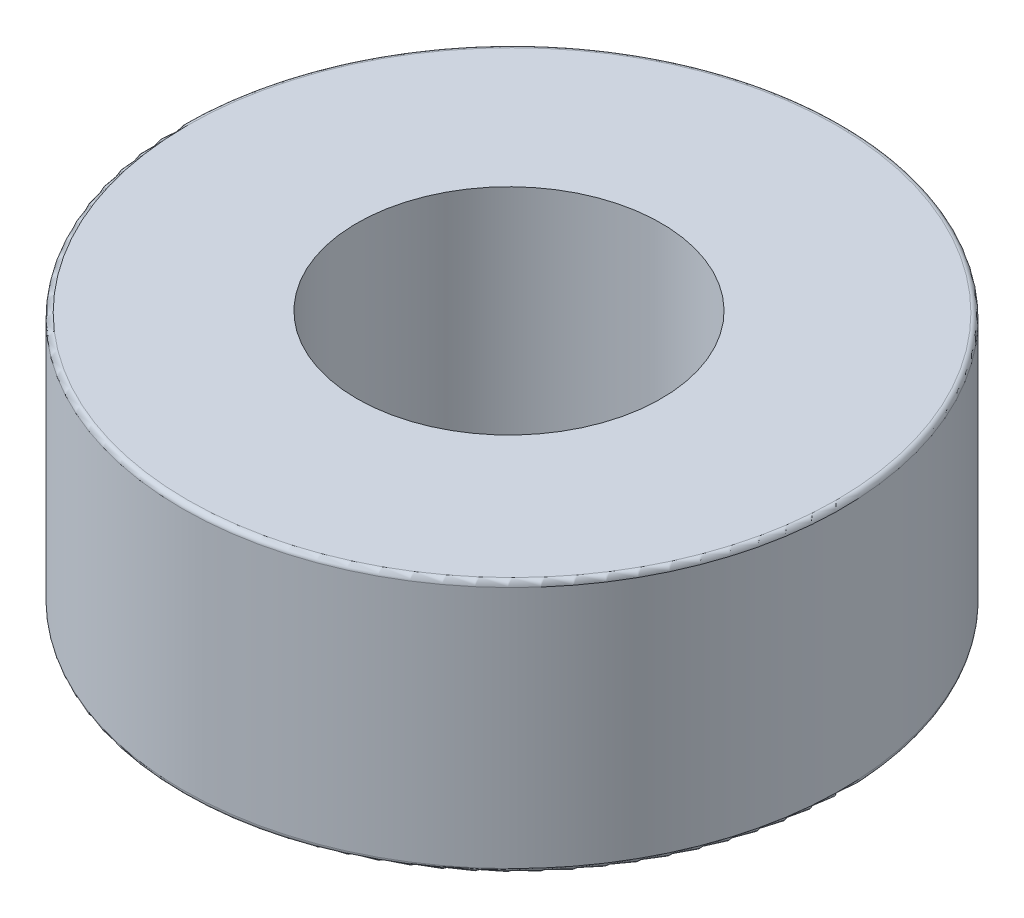
ISO-10303-21;
HEADER;
FILE_DESCRIPTION(('STEP AP214'),'2;1');
FILE_NAME('part.step','',(''),(''),'','','');
FILE_SCHEMA(('AUTOMOTIVE_DESIGN { 1 0 10303 214 1 1 1 1 }'));
ENDSEC;
DATA;
#1=APPLICATION_CONTEXT('core data for automotive mechanical design processes');
#2=APPLICATION_PROTOCOL_DEFINITION('international standard','automotive_design',2000,#1);
#3=PRODUCT_CONTEXT('',#1,'mechanical');
#4=PRODUCT('Part','Part','',(#3));
#5=PRODUCT_RELATED_PRODUCT_CATEGORY('part','',(#4));
#6=PRODUCT_DEFINITION_FORMATION('','',#4);
#7=PRODUCT_DEFINITION_CONTEXT('part definition',#1,'design');
#8=PRODUCT_DEFINITION('design','',#6,#7);
#9=PRODUCT_DEFINITION_SHAPE('','',#8);
#10=(LENGTH_UNIT() NAMED_UNIT(*) SI_UNIT(.MILLI.,.METRE.));
#11=(NAMED_UNIT(*) PLANE_ANGLE_UNIT() SI_UNIT($,.RADIAN.));
#12=(NAMED_UNIT(*) SI_UNIT($,.STERADIAN.) SOLID_ANGLE_UNIT());
#13=UNCERTAINTY_MEASURE_WITH_UNIT(LENGTH_MEASURE(1.E-05),#10,'distance_accuracy_value','');
#14=(GEOMETRIC_REPRESENTATION_CONTEXT(3) GLOBAL_UNCERTAINTY_ASSIGNED_CONTEXT((#13)) GLOBAL_UNIT_ASSIGNED_CONTEXT((#10,
#11,#12)) REPRESENTATION_CONTEXT('',''));
#15=CARTESIAN_POINT('',(0.,0.,0.));
#16=DIRECTION('',(0.,0.,1.));
#17=DIRECTION('',(1.,0.,0.));
#18=AXIS2_PLACEMENT_3D('',#15,#16,#17);
#19=CARTESIAN_POINT('',(0.0597931372441155,5.,0.));
#20=DIRECTION('',(0.,1.,0.));
#21=DIRECTION('',(0.,0.,1.));
#22=AXIS2_PLACEMENT_3D('',#19,#20,#21);
#23=PLANE('',#22);
#24=CARTESIAN_POINT('',(0.0597931372441155,5.,0.));
#25=DIRECTION('',(0.,1.,0.));
#26=DIRECTION('',(0.,0.,1.));
#27=AXIS2_PLACEMENT_3D('',#24,#25,#26);
#28=CIRCLE('',#27,6.4);
#29=CARTESIAN_POINT('',(0.0597931372441155,5.,6.4));
#30=VERTEX_POINT('',#29);
#31=EDGE_CURVE('E10',#30,#30,#28,.T.);
#32=ORIENTED_EDGE('',*,*,#31,.T.);
#33=EDGE_LOOP('',(#32));
#34=FACE_BOUND('',#33,.T.);
#35=CARTESIAN_POINT('',(0.,5.,0.));
#36=DIRECTION('',(0.,1.,0.));
#37=DIRECTION('',(0.,0.,1.));
#38=AXIS2_PLACEMENT_3D('',#35,#36,#37);
#39=CIRCLE('',#38,3.);
#40=CARTESIAN_POINT('',(0.,5.,3.));
#41=VERTEX_POINT('',#40);
#42=EDGE_CURVE('E65',#41,#41,#39,.T.);
#43=ORIENTED_EDGE('',*,*,#42,.F.);
#44=EDGE_LOOP('',(#43));
#45=FACE_BOUND('',#44,.T.);
#46=ADVANCED_FACE('F41',(#34,#45),#23,.T.);
#47=CARTESIAN_POINT('',(0.0597931372441155,0.,0.));
#48=DIRECTION('',(0.,1.,0.));
#49=DIRECTION('',(0.,0.,1.));
#50=AXIS2_PLACEMENT_3D('',#47,#48,#49);
#51=PLANE('',#50);
#52=CARTESIAN_POINT('',(0.0597931372441155,0.,0.));
#53=DIRECTION('',(0.,1.,0.));
#54=DIRECTION('',(0.,0.,1.));
#55=AXIS2_PLACEMENT_3D('',#52,#53,#54);
#56=CIRCLE('',#55,6.4);
#57=CARTESIAN_POINT('',(0.0597931372441155,0.,6.4));
#58=VERTEX_POINT('',#57);
#59=EDGE_CURVE('E49',#58,#58,#56,.F.);
#60=ORIENTED_EDGE('',*,*,#59,.T.);
#61=EDGE_LOOP('',(#60));
#62=FACE_BOUND('',#61,.T.);
#63=CARTESIAN_POINT('',(0.,0.,0.));
#64=DIRECTION('',(0.,1.,0.));
#65=DIRECTION('',(0.,0.,1.));
#66=AXIS2_PLACEMENT_3D('',#63,#64,#65);
#67=CIRCLE('',#66,3.);
#68=CARTESIAN_POINT('',(0.,0.,3.));
#69=VERTEX_POINT('',#68);
#70=EDGE_CURVE('E66',#69,#69,#67,.T.);
#71=ORIENTED_EDGE('',*,*,#70,.T.);
#72=EDGE_LOOP('',(#71));
#73=FACE_BOUND('',#72,.T.);
#74=ADVANCED_FACE('F78',(#62,#73),#51,.F.);
#75=CARTESIAN_POINT('',(0.0597931372441155,5.,0.));
#76=DIRECTION('',(0.,-1.,0.));
#77=DIRECTION('',(0.,0.,-1.));
#78=AXIS2_PLACEMENT_3D('',#75,#76,#77);
#79=CYLINDRICAL_SURFACE('',#78,6.5);
#80=CARTESIAN_POINT('',(0.0597931372441155,0.1,0.));
#81=DIRECTION('',(0.,1.,0.));
#82=DIRECTION('',(0.,0.,1.));
#83=AXIS2_PLACEMENT_3D('',#80,#81,#82);
#84=CIRCLE('',#83,6.5);
#85=CARTESIAN_POINT('',(0.0597931372441155,0.1,6.5));
#86=VERTEX_POINT('',#85);
#87=EDGE_CURVE('E54',#86,#86,#84,.T.);
#88=ORIENTED_EDGE('',*,*,#87,.T.);
#89=EDGE_LOOP('',(#88));
#90=FACE_BOUND('',#89,.T.);
#91=CARTESIAN_POINT('',(0.0597931372441155,4.9,0.));
#92=DIRECTION('',(0.,1.,0.));
#93=DIRECTION('',(0.,0.,1.));
#94=AXIS2_PLACEMENT_3D('',#91,#92,#93);
#95=CIRCLE('',#94,6.5);
#96=CARTESIAN_POINT('',(0.0597931372441155,4.9,6.5));
#97=VERTEX_POINT('',#96);
#98=EDGE_CURVE('E59',#97,#97,#95,.F.);
#99=ORIENTED_EDGE('',*,*,#98,.T.);
#100=EDGE_LOOP('',(#99));
#101=FACE_BOUND('',#100,.T.);
#102=ADVANCED_FACE('F83',(#90,#101),#79,.T.);
#103=CARTESIAN_POINT('',(0.,5.,0.));
#104=DIRECTION('',(0.,-1.,0.));
#105=DIRECTION('',(0.,0.,-1.));
#106=AXIS2_PLACEMENT_3D('',#103,#104,#105);
#107=CYLINDRICAL_SURFACE('',#106,3.);
#108=ORIENTED_EDGE('',*,*,#42,.T.);
#109=EDGE_LOOP('',(#108));
#110=FACE_BOUND('',#109,.T.);
#111=ORIENTED_EDGE('',*,*,#70,.F.);
#112=EDGE_LOOP('',(#111));
#113=FACE_BOUND('',#112,.T.);
#114=ADVANCED_FACE('F74',(#110,#113),#107,.F.);
#115=CARTESIAN_POINT('',(0.0597931372441155,0.1,0.));
#116=DIRECTION('',(0.,1.,0.));
#117=DIRECTION('',(0.,0.,1.));
#118=AXIS2_PLACEMENT_3D('',#115,#116,#117);
#119=TOROIDAL_SURFACE('',#118,6.4,0.1);
#120=ORIENTED_EDGE('',*,*,#59,.F.);
#121=EDGE_LOOP('',(#120));
#122=FACE_BOUND('',#121,.T.);
#123=ORIENTED_EDGE('',*,*,#87,.F.);
#124=EDGE_LOOP('',(#123));
#125=FACE_BOUND('',#124,.T.);
#126=ADVANCED_FACE('F89',(#122,#125),#119,.T.);
#127=CARTESIAN_POINT('',(0.0597931372441155,4.9,0.));
#128=DIRECTION('',(0.,1.,0.));
#129=DIRECTION('',(0.,0.,1.));
#130=AXIS2_PLACEMENT_3D('',#127,#128,#129);
#131=TOROIDAL_SURFACE('',#130,6.4,0.1);
#132=ORIENTED_EDGE('',*,*,#98,.F.);
#133=EDGE_LOOP('',(#132));
#134=FACE_BOUND('',#133,.T.);
#135=ORIENTED_EDGE('',*,*,#31,.F.);
#136=EDGE_LOOP('',(#135));
#137=FACE_BOUND('',#136,.T.);
#138=ADVANCED_FACE('F43',(#134,#137),#131,.T.);
#139=CLOSED_SHELL('',(#46,#74,#102,#114,#126,#138));
#140=MANIFOLD_SOLID_BREP('B2',#139);
#141=ADVANCED_BREP_SHAPE_REPRESENTATION('',(#18,#140),#14);
#142=SHAPE_DEFINITION_REPRESENTATION(#9,#141);
ENDSEC;
END-ISO-10303-21;
